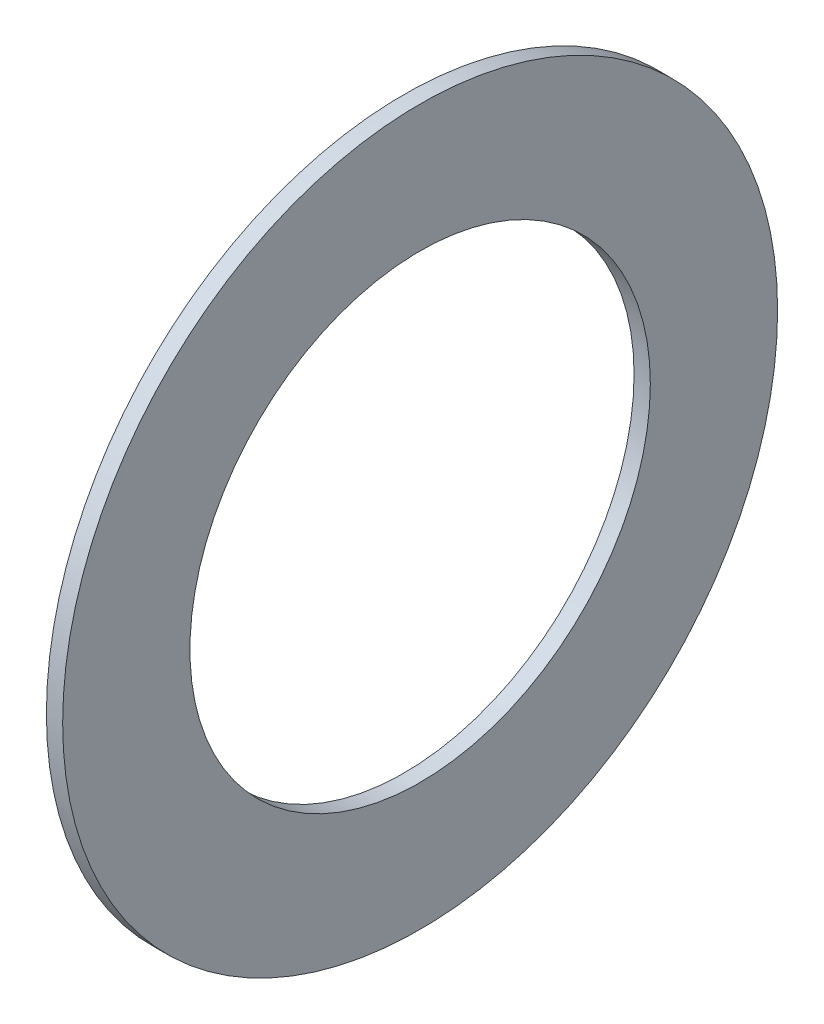
ISO-10303-21;
HEADER;
FILE_DESCRIPTION(('STEP AP214'),'2;1');
FILE_NAME('part.step','',(''),(''),'','','');
FILE_SCHEMA(('AUTOMOTIVE_DESIGN { 1 0 10303 214 1 1 1 1 }'));
ENDSEC;
DATA;
#1=APPLICATION_CONTEXT('core data for automotive mechanical design processes');
#2=APPLICATION_PROTOCOL_DEFINITION('international standard','automotive_design',2000,#1);
#3=PRODUCT_CONTEXT('',#1,'mechanical');
#4=PRODUCT('Part','Part','',(#3));
#5=PRODUCT_RELATED_PRODUCT_CATEGORY('part','',(#4));
#6=PRODUCT_DEFINITION_FORMATION('','',#4);
#7=PRODUCT_DEFINITION_CONTEXT('part definition',#1,'design');
#8=PRODUCT_DEFINITION('design','',#6,#7);
#9=PRODUCT_DEFINITION_SHAPE('','',#8);
#10=(LENGTH_UNIT() NAMED_UNIT(*) SI_UNIT(.MILLI.,.METRE.));
#11=(NAMED_UNIT(*) PLANE_ANGLE_UNIT() SI_UNIT($,.RADIAN.));
#12=(NAMED_UNIT(*) SI_UNIT($,.STERADIAN.) SOLID_ANGLE_UNIT());
#13=UNCERTAINTY_MEASURE_WITH_UNIT(LENGTH_MEASURE(1.E-05),#10,'distance_accuracy_value','');
#14=(GEOMETRIC_REPRESENTATION_CONTEXT(3) GLOBAL_UNCERTAINTY_ASSIGNED_CONTEXT((#13)) GLOBAL_UNIT_ASSIGNED_CONTEXT((#10,
#11,#12)) REPRESENTATION_CONTEXT('',''));
#15=CARTESIAN_POINT('',(0.,0.,0.));
#16=DIRECTION('',(0.,0.,1.));
#17=DIRECTION('',(1.,0.,0.));
#18=AXIS2_PLACEMENT_3D('',#15,#16,#17);
#19=CARTESIAN_POINT('',(0.4,0.,5.425));
#20=DIRECTION('',(1.,0.,0.));
#21=DIRECTION('',(0.,0.,-1.));
#22=AXIS2_PLACEMENT_3D('',#19,#20,#21);
#23=PLANE('',#22);
#24=CARTESIAN_POINT('',(0.4,0.,0.));
#25=DIRECTION('',(1.,0.,0.));
#26=DIRECTION('',(0.,0.,-1.));
#27=AXIS2_PLACEMENT_3D('',#24,#25,#26);
#28=CIRCLE('',#27,6.6);
#29=CARTESIAN_POINT('',(0.4,0.,-6.6));
#30=VERTEX_POINT('',#29);
#31=EDGE_CURVE('E17',#30,#30,#28,.F.);
#32=ORIENTED_EDGE('',*,*,#31,.F.);
#33=EDGE_LOOP('',(#32));
#34=FACE_BOUND('',#33,.T.);
#35=CARTESIAN_POINT('',(0.4,0.,0.));
#36=DIRECTION('',(1.,0.,0.));
#37=DIRECTION('',(0.,0.,-1.));
#38=AXIS2_PLACEMENT_3D('',#35,#36,#37);
#39=CIRCLE('',#38,4.25);
#40=CARTESIAN_POINT('',(0.4,0.,-4.25));
#41=VERTEX_POINT('',#40);
#42=EDGE_CURVE('E26',#41,#41,#39,.T.);
#43=ORIENTED_EDGE('',*,*,#42,.F.);
#44=EDGE_LOOP('',(#43));
#45=FACE_BOUND('',#44,.T.);
#46=ADVANCED_FACE('F14',(#34,#45),#23,.T.);
#47=CARTESIAN_POINT('',(0.25,0.,0.));
#48=DIRECTION('',(1.,0.,0.));
#49=DIRECTION('',(0.,0.,-1.));
#50=AXIS2_PLACEMENT_3D('',#47,#48,#49);
#51=CYLINDRICAL_SURFACE('',#50,6.6);
#52=ORIENTED_EDGE('',*,*,#31,.T.);
#53=EDGE_LOOP('',(#52));
#54=FACE_BOUND('',#53,.T.);
#55=CARTESIAN_POINT('',(0.1,0.,0.));
#56=DIRECTION('',(1.,0.,0.));
#57=DIRECTION('',(0.,0.,-1.));
#58=AXIS2_PLACEMENT_3D('',#55,#56,#57);
#59=CIRCLE('',#58,6.6);
#60=CARTESIAN_POINT('',(0.1,0.,-6.6));
#61=VERTEX_POINT('',#60);
#62=EDGE_CURVE('E21',#61,#61,#59,.F.);
#63=ORIENTED_EDGE('',*,*,#62,.F.);
#64=EDGE_LOOP('',(#63));
#65=FACE_BOUND('',#64,.T.);
#66=ADVANCED_FACE('F34',(#54,#65),#51,.T.);
#67=CARTESIAN_POINT('',(0.1,0.,0.));
#68=DIRECTION('',(1.,0.,0.));
#69=DIRECTION('',(0.,0.,-1.));
#70=AXIS2_PLACEMENT_3D('',#67,#68,#69);
#71=CYLINDRICAL_SURFACE('',#70,4.25);
#72=CARTESIAN_POINT('',(0.1,0.,0.));
#73=DIRECTION('',(1.,0.,0.));
#74=DIRECTION('',(0.,0.,-1.));
#75=AXIS2_PLACEMENT_3D('',#72,#73,#74);
#76=CIRCLE('',#75,4.25);
#77=CARTESIAN_POINT('',(0.1,0.,-4.25));
#78=VERTEX_POINT('',#77);
#79=EDGE_CURVE('E10',#78,#78,#76,.T.);
#80=ORIENTED_EDGE('',*,*,#79,.F.);
#81=EDGE_LOOP('',(#80));
#82=FACE_BOUND('',#81,.T.);
#83=ORIENTED_EDGE('',*,*,#42,.T.);
#84=EDGE_LOOP('',(#83));
#85=FACE_BOUND('',#84,.T.);
#86=ADVANCED_FACE('F43',(#82,#85),#71,.F.);
#87=CARTESIAN_POINT('',(0.1,0.,5.425));
#88=DIRECTION('',(-1.,0.,0.));
#89=DIRECTION('',(0.,0.,1.));
#90=AXIS2_PLACEMENT_3D('',#87,#88,#89);
#91=PLANE('',#90);
#92=ORIENTED_EDGE('',*,*,#79,.T.);
#93=EDGE_LOOP('',(#92));
#94=FACE_BOUND('',#93,.T.);
#95=ORIENTED_EDGE('',*,*,#62,.T.);
#96=EDGE_LOOP('',(#95));
#97=FACE_BOUND('',#96,.T.);
#98=ADVANCED_FACE('F44',(#94,#97),#91,.T.);
#99=CLOSED_SHELL('',(#46,#66,#86,#98));
#100=MANIFOLD_SOLID_BREP('B1',#99);
#101=ADVANCED_BREP_SHAPE_REPRESENTATION('',(#18,#100),#14);
#102=SHAPE_DEFINITION_REPRESENTATION(#9,#101);
ENDSEC;
END-ISO-10303-21;
